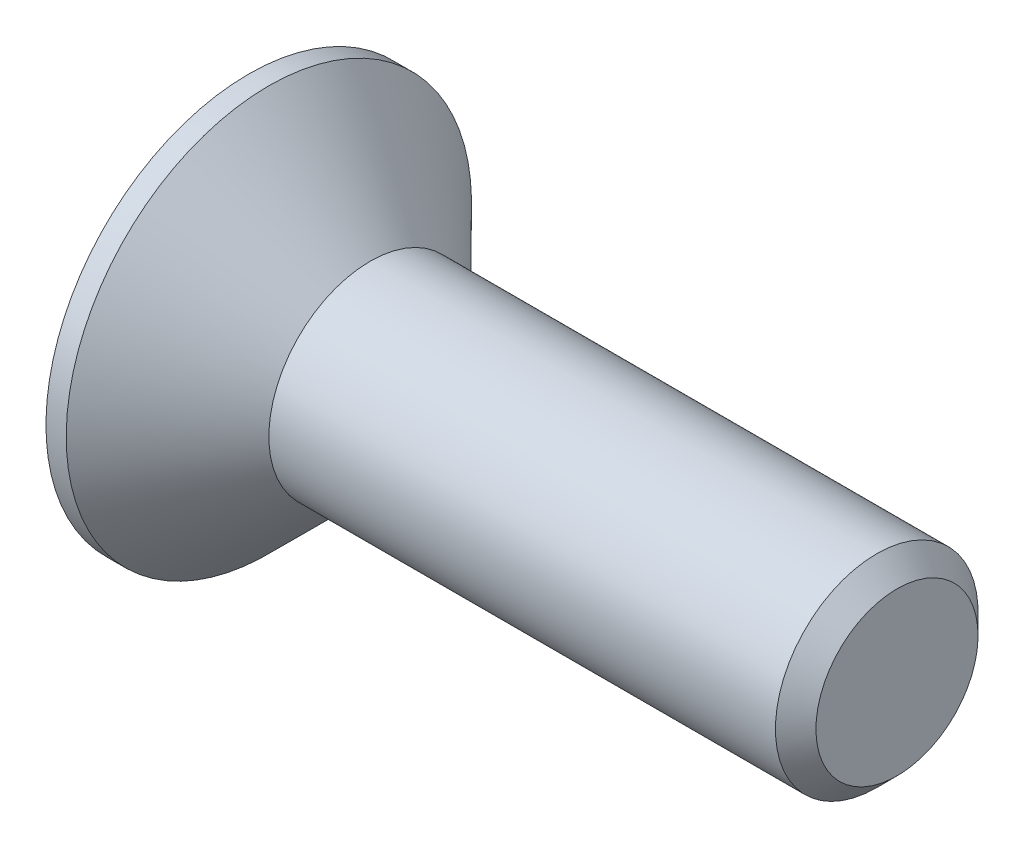
ISO-10303-21;
HEADER;
FILE_DESCRIPTION(('STEP AP214'),'2;1');
FILE_NAME('part.step','',(''),(''),'','','');
FILE_SCHEMA(('AUTOMOTIVE_DESIGN { 1 0 10303 214 1 1 1 1 }'));
ENDSEC;
DATA;
#1=APPLICATION_CONTEXT('core data for automotive mechanical design processes');
#2=APPLICATION_PROTOCOL_DEFINITION('international standard','automotive_design',2000,#1);
#3=PRODUCT_CONTEXT('',#1,'mechanical');
#4=PRODUCT('Part','Part','',(#3));
#5=PRODUCT_RELATED_PRODUCT_CATEGORY('part','',(#4));
#6=PRODUCT_DEFINITION_FORMATION('','',#4);
#7=PRODUCT_DEFINITION_CONTEXT('part definition',#1,'design');
#8=PRODUCT_DEFINITION('design','',#6,#7);
#9=PRODUCT_DEFINITION_SHAPE('','',#8);
#10=(LENGTH_UNIT() NAMED_UNIT(*) SI_UNIT(.MILLI.,.METRE.));
#11=(NAMED_UNIT(*) PLANE_ANGLE_UNIT() SI_UNIT($,.RADIAN.));
#12=(NAMED_UNIT(*) SI_UNIT($,.STERADIAN.) SOLID_ANGLE_UNIT());
#13=UNCERTAINTY_MEASURE_WITH_UNIT(LENGTH_MEASURE(1.E-05),#10,'distance_accuracy_value','');
#14=(GEOMETRIC_REPRESENTATION_CONTEXT(3) GLOBAL_UNCERTAINTY_ASSIGNED_CONTEXT((#13)) GLOBAL_UNIT_ASSIGNED_CONTEXT((#10,
#11,#12)) REPRESENTATION_CONTEXT('',''));
#15=CARTESIAN_POINT('',(0.,0.,0.));
#16=DIRECTION('',(0.,0.,1.));
#17=DIRECTION('',(1.,0.,0.));
#18=AXIS2_PLACEMENT_3D('',#15,#16,#17);
#19=CARTESIAN_POINT('',(0.,0.,0.));
#20=DIRECTION('',(-1.,0.,0.));
#21=DIRECTION('',(0.,-1.,0.));
#22=AXIS2_PLACEMENT_3D('',#19,#20,#21);
#23=PLANE('',#22);
#24=DIRECTION('',(0.,0.5,-0.866025403784439));
#25=VECTOR('',#24,1.);
#26=CARTESIAN_POINT('',(0.,0.866025403784439,1.5));
#27=LINE('',#26,#25);
#28=CARTESIAN_POINT('',(0.,0.866025403784439,1.5));
#29=VERTEX_POINT('',#28);
#30=CARTESIAN_POINT('',(0.,1.73205080756888,0.));
#31=VERTEX_POINT('',#30);
#32=EDGE_CURVE('E48',#29,#31,#27,.T.);
#33=ORIENTED_EDGE('',*,*,#32,.F.);
#34=DIRECTION('',(0.,1.,0.));
#35=VECTOR('',#34,1.);
#36=CARTESIAN_POINT('',(0.,-0.86602540378444,1.5));
#37=LINE('',#36,#35);
#38=CARTESIAN_POINT('',(0.,-0.86602540378444,1.5));
#39=VERTEX_POINT('',#38);
#40=EDGE_CURVE('E131',#39,#29,#37,.T.);
#41=ORIENTED_EDGE('',*,*,#40,.F.);
#42=DIRECTION('',(0.,0.5,0.866025403784439));
#43=VECTOR('',#42,1.);
#44=CARTESIAN_POINT('',(0.,-1.73205080756888,0.));
#45=LINE('',#44,#43);
#46=CARTESIAN_POINT('',(0.,-1.73205080756888,0.));
#47=VERTEX_POINT('',#46);
#48=EDGE_CURVE('E129',#47,#39,#45,.T.);
#49=ORIENTED_EDGE('',*,*,#48,.F.);
#50=DIRECTION('',(0.,-0.5,0.866025403784438));
#51=VECTOR('',#50,1.);
#52=CARTESIAN_POINT('',(0.,-0.866025403784439,-1.5));
#53=LINE('',#52,#51);
#54=CARTESIAN_POINT('',(0.,-0.866025403784439,-1.5));
#55=VERTEX_POINT('',#54);
#56=EDGE_CURVE('E96',#55,#47,#53,.T.);
#57=ORIENTED_EDGE('',*,*,#56,.F.);
#58=DIRECTION('',(0.,-1.,0.));
#59=VECTOR('',#58,1.);
#60=CARTESIAN_POINT('',(0.,0.866025403784439,-1.5));
#61=LINE('',#60,#59);
#62=CARTESIAN_POINT('',(0.,0.866025403784439,-1.5));
#63=VERTEX_POINT('',#62);
#64=EDGE_CURVE('E125',#63,#55,#61,.T.);
#65=ORIENTED_EDGE('',*,*,#64,.F.);
#66=DIRECTION('',(0.,-0.5,-0.866025403784439));
#67=VECTOR('',#66,1.);
#68=CARTESIAN_POINT('',(0.,1.73205080756888,0.));
#69=LINE('',#68,#67);
#70=EDGE_CURVE('E122',#31,#63,#69,.T.);
#71=ORIENTED_EDGE('',*,*,#70,.F.);
#72=EDGE_LOOP('',(#33,#41,#49,#57,#65,#71));
#73=FACE_BOUND('',#72,.T.);
#74=CARTESIAN_POINT('',(0.,0.,0.));
#75=DIRECTION('',(1.,0.,0.));
#76=DIRECTION('',(0.,1.,0.));
#77=AXIS2_PLACEMENT_3D('',#74,#75,#76);
#78=CIRCLE('',#77,5.);
#79=CARTESIAN_POINT('',(0.,5.,0.));
#80=VERTEX_POINT('',#79);
#81=EDGE_CURVE('E146',#80,#80,#78,.T.);
#82=ORIENTED_EDGE('',*,*,#81,.F.);
#83=EDGE_LOOP('',(#82));
#84=FACE_BOUND('',#83,.T.);
#85=ADVANCED_FACE('F33',(#73,#84),#23,.T.);
#86=CARTESIAN_POINT('',(16.,0.,0.));
#87=DIRECTION('',(1.,0.,0.));
#88=DIRECTION('',(0.,1.,0.));
#89=AXIS2_PLACEMENT_3D('',#86,#87,#88);
#90=CYLINDRICAL_SURFACE('',#89,5.);
#91=ORIENTED_EDGE('',*,*,#81,.T.);
#92=EDGE_LOOP('',(#91));
#93=FACE_BOUND('',#92,.T.);
#94=CARTESIAN_POINT('',(0.49999999999994,0.,0.));
#95=DIRECTION('',(1.,0.,0.));
#96=DIRECTION('',(0.,1.,0.));
#97=AXIS2_PLACEMENT_3D('',#94,#95,#96);
#98=CIRCLE('',#97,5.);
#99=CARTESIAN_POINT('',(0.499999999999939,5.,0.));
#100=VERTEX_POINT('',#99);
#101=EDGE_CURVE('E143',#100,#100,#98,.T.);
#102=ORIENTED_EDGE('',*,*,#101,.F.);
#103=EDGE_LOOP('',(#102));
#104=FACE_BOUND('',#103,.T.);
#105=ADVANCED_FACE('F166',(#93,#104),#90,.T.);
#106=CARTESIAN_POINT('',(3.,0.,0.));
#107=DIRECTION('',(-1.,0.,0.));
#108=DIRECTION('',(0.,-1.,0.));
#109=AXIS2_PLACEMENT_3D('',#106,#107,#108);
#110=CONICAL_SURFACE('',#109,2.5,0.785398163397437);
#111=ORIENTED_EDGE('',*,*,#101,.T.);
#112=EDGE_LOOP('',(#111));
#113=FACE_BOUND('',#112,.T.);
#114=CARTESIAN_POINT('',(3.,0.,0.));
#115=DIRECTION('',(1.,0.,0.));
#116=DIRECTION('',(0.,1.,0.));
#117=AXIS2_PLACEMENT_3D('',#114,#115,#116);
#118=CIRCLE('',#117,2.5);
#119=CARTESIAN_POINT('',(3.,2.5,0.));
#120=VERTEX_POINT('',#119);
#121=EDGE_CURVE('E135',#120,#120,#118,.T.);
#122=ORIENTED_EDGE('',*,*,#121,.F.);
#123=EDGE_LOOP('',(#122));
#124=FACE_BOUND('',#123,.T.);
#125=ADVANCED_FACE('F171',(#113,#124),#110,.T.);
#126=CARTESIAN_POINT('',(16.,0.,0.));
#127=DIRECTION('',(1.,0.,0.));
#128=DIRECTION('',(0.,1.,0.));
#129=AXIS2_PLACEMENT_3D('',#126,#127,#128);
#130=CYLINDRICAL_SURFACE('',#129,2.5);
#131=CARTESIAN_POINT('',(15.5,0.,0.));
#132=DIRECTION('',(1.,0.,0.));
#133=DIRECTION('',(0.,1.,0.));
#134=AXIS2_PLACEMENT_3D('',#131,#132,#133);
#135=CIRCLE('',#134,2.5);
#136=CARTESIAN_POINT('',(15.5,2.5,0.));
#137=VERTEX_POINT('',#136);
#138=EDGE_CURVE('E11',#137,#137,#135,.F.);
#139=ORIENTED_EDGE('',*,*,#138,.T.);
#140=EDGE_LOOP('',(#139));
#141=FACE_BOUND('',#140,.T.);
#142=ORIENTED_EDGE('',*,*,#121,.T.);
#143=EDGE_LOOP('',(#142));
#144=FACE_BOUND('',#143,.T.);
#145=ADVANCED_FACE('F162',(#141,#144),#130,.T.);
#146=CARTESIAN_POINT('',(16.,2.5,0.));
#147=DIRECTION('',(1.,0.,0.));
#148=DIRECTION('',(0.,1.,0.));
#149=AXIS2_PLACEMENT_3D('',#146,#147,#148);
#150=PLANE('',#149);
#151=CARTESIAN_POINT('',(16.,0.,0.));
#152=DIRECTION('',(1.,0.,0.));
#153=DIRECTION('',(0.,1.,0.));
#154=AXIS2_PLACEMENT_3D('',#151,#152,#153);
#155=CIRCLE('',#154,1.99999999999999);
#156=CARTESIAN_POINT('',(16.,2.,0.));
#157=VERTEX_POINT('',#156);
#158=EDGE_CURVE('E41',#157,#157,#155,.T.);
#159=ORIENTED_EDGE('',*,*,#158,.T.);
#160=EDGE_LOOP('',(#159));
#161=FACE_BOUND('',#160,.T.);
#162=ADVANCED_FACE('F151',(#161),#150,.T.);
#163=CARTESIAN_POINT('',(16.,0.,0.));
#164=DIRECTION('',(-1.,0.,0.));
#165=DIRECTION('',(0.,-1.,0.));
#166=AXIS2_PLACEMENT_3D('',#163,#164,#165);
#167=CONICAL_SURFACE('',#166,1.99999999999999,0.785398163397445);
#168=ORIENTED_EDGE('',*,*,#138,.F.);
#169=EDGE_LOOP('',(#168));
#170=FACE_BOUND('',#169,.T.);
#171=ORIENTED_EDGE('',*,*,#158,.F.);
#172=EDGE_LOOP('',(#171));
#173=FACE_BOUND('',#172,.T.);
#174=ADVANCED_FACE('F35',(#170,#173),#167,.T.);
#175=CARTESIAN_POINT('',(2.3,0.866025403784438,1.5));
#176=DIRECTION('',(0.,0.866025403784439,0.5));
#177=DIRECTION('',(0.,-0.5,0.866025403784439));
#178=AXIS2_PLACEMENT_3D('',#175,#176,#177);
#179=PLANE('',#178);
#180=ORIENTED_EDGE('',*,*,#32,.T.);
#181=DIRECTION('',(-1.,0.,0.));
#182=VECTOR('',#181,1.);
#183=CARTESIAN_POINT('',(2.3,1.73205080756888,0.));
#184=LINE('',#183,#182);
#185=CARTESIAN_POINT('',(2.3,1.73205080756888,0.));
#186=VERTEX_POINT('',#185);
#187=EDGE_CURVE('E78',#186,#31,#184,.T.);
#188=ORIENTED_EDGE('',*,*,#187,.F.);
#189=DIRECTION('',(0.,0.5,-0.866025403784439));
#190=VECTOR('',#189,1.);
#191=CARTESIAN_POINT('',(2.3,0.866025403784438,1.5));
#192=LINE('',#191,#190);
#193=CARTESIAN_POINT('',(2.3,0.866025403784438,1.5));
#194=VERTEX_POINT('',#193);
#195=EDGE_CURVE('E133',#194,#186,#192,.T.);
#196=ORIENTED_EDGE('',*,*,#195,.F.);
#197=DIRECTION('',(-1.,0.,0.));
#198=VECTOR('',#197,1.);
#199=CARTESIAN_POINT('',(2.3,0.866025403784438,1.5));
#200=LINE('',#199,#198);
#201=EDGE_CURVE('E56',#194,#29,#200,.T.);
#202=ORIENTED_EDGE('',*,*,#201,.T.);
#203=EDGE_LOOP('',(#180,#188,#196,#202));
#204=FACE_BOUND('',#203,.T.);
#205=ADVANCED_FACE('F154',(#204),#179,.F.);
#206=CARTESIAN_POINT('',(2.3,-0.86602540378444,1.5));
#207=DIRECTION('',(0.,0.,1.));
#208=DIRECTION('',(0.,-1.,0.));
#209=AXIS2_PLACEMENT_3D('',#206,#207,#208);
#210=PLANE('',#209);
#211=ORIENTED_EDGE('',*,*,#40,.T.);
#212=ORIENTED_EDGE('',*,*,#201,.F.);
#213=DIRECTION('',(0.,1.,0.));
#214=VECTOR('',#213,1.);
#215=CARTESIAN_POINT('',(2.3,-0.86602540378444,1.5));
#216=LINE('',#215,#214);
#217=CARTESIAN_POINT('',(2.3,-0.86602540378444,1.5));
#218=VERTEX_POINT('',#217);
#219=EDGE_CURVE('E108',#218,#194,#216,.T.);
#220=ORIENTED_EDGE('',*,*,#219,.F.);
#221=DIRECTION('',(-1.,0.,0.));
#222=VECTOR('',#221,1.);
#223=CARTESIAN_POINT('',(2.3,-0.86602540378444,1.5));
#224=LINE('',#223,#222);
#225=EDGE_CURVE('E100',#218,#39,#224,.T.);
#226=ORIENTED_EDGE('',*,*,#225,.T.);
#227=EDGE_LOOP('',(#211,#212,#220,#226));
#228=FACE_BOUND('',#227,.T.);
#229=ADVANCED_FACE('F160',(#228),#210,.F.);
#230=CARTESIAN_POINT('',(2.3,-1.73205080756888,0.));
#231=DIRECTION('',(0.,-0.866025403784439,0.5));
#232=DIRECTION('',(0.,-0.5,-0.866025403784439));
#233=AXIS2_PLACEMENT_3D('',#230,#231,#232);
#234=PLANE('',#233);
#235=ORIENTED_EDGE('',*,*,#48,.T.);
#236=ORIENTED_EDGE('',*,*,#225,.F.);
#237=DIRECTION('',(0.,0.5,0.866025403784439));
#238=VECTOR('',#237,1.);
#239=CARTESIAN_POINT('',(2.3,-1.73205080756888,0.));
#240=LINE('',#239,#238);
#241=CARTESIAN_POINT('',(2.3,-1.73205080756888,0.));
#242=VERTEX_POINT('',#241);
#243=EDGE_CURVE('E104',#242,#218,#240,.T.);
#244=ORIENTED_EDGE('',*,*,#243,.F.);
#245=DIRECTION('',(-1.,0.,0.));
#246=VECTOR('',#245,1.);
#247=CARTESIAN_POINT('',(2.3,-1.73205080756888,0.));
#248=LINE('',#247,#246);
#249=EDGE_CURVE('E89',#242,#47,#248,.T.);
#250=ORIENTED_EDGE('',*,*,#249,.T.);
#251=EDGE_LOOP('',(#235,#236,#244,#250));
#252=FACE_BOUND('',#251,.T.);
#253=ADVANCED_FACE('F105',(#252),#234,.F.);
#254=CARTESIAN_POINT('',(2.3,-0.866025403784439,-1.5));
#255=DIRECTION('',(0.,-0.866025403784439,-0.5));
#256=DIRECTION('',(0.,0.5,-0.866025403784439));
#257=AXIS2_PLACEMENT_3D('',#254,#255,#256);
#258=PLANE('',#257);
#259=ORIENTED_EDGE('',*,*,#56,.T.);
#260=ORIENTED_EDGE('',*,*,#249,.F.);
#261=DIRECTION('',(0.,-0.5,0.866025403784438));
#262=VECTOR('',#261,1.);
#263=CARTESIAN_POINT('',(2.3,-0.866025403784439,-1.5));
#264=LINE('',#263,#262);
#265=CARTESIAN_POINT('',(2.3,-0.866025403784439,-1.5));
#266=VERTEX_POINT('',#265);
#267=EDGE_CURVE('E93',#266,#242,#264,.T.);
#268=ORIENTED_EDGE('',*,*,#267,.F.);
#269=DIRECTION('',(-1.,0.,0.));
#270=VECTOR('',#269,1.);
#271=CARTESIAN_POINT('',(2.3,-0.866025403784439,-1.5));
#272=LINE('',#271,#270);
#273=EDGE_CURVE('E101',#266,#55,#272,.T.);
#274=ORIENTED_EDGE('',*,*,#273,.T.);
#275=EDGE_LOOP('',(#259,#260,#268,#274));
#276=FACE_BOUND('',#275,.T.);
#277=ADVANCED_FACE('F91',(#276),#258,.F.);
#278=CARTESIAN_POINT('',(2.3,0.866025403784438,-1.5));
#279=DIRECTION('',(0.,0.,-1.));
#280=DIRECTION('',(-1.,0.,0.));
#281=AXIS2_PLACEMENT_3D('',#278,#279,#280);
#282=PLANE('',#281);
#283=ORIENTED_EDGE('',*,*,#64,.T.);
#284=ORIENTED_EDGE('',*,*,#273,.F.);
#285=DIRECTION('',(0.,-1.,0.));
#286=VECTOR('',#285,1.);
#287=CARTESIAN_POINT('',(2.3,0.866025403784438,-1.5));
#288=LINE('',#287,#286);
#289=CARTESIAN_POINT('',(2.3,0.866025403784438,-1.5));
#290=VERTEX_POINT('',#289);
#291=EDGE_CURVE('E114',#290,#266,#288,.T.);
#292=ORIENTED_EDGE('',*,*,#291,.F.);
#293=DIRECTION('',(-1.,0.,0.));
#294=VECTOR('',#293,1.);
#295=CARTESIAN_POINT('',(2.3,0.866025403784438,-1.5));
#296=LINE('',#295,#294);
#297=EDGE_CURVE('E138',#290,#63,#296,.T.);
#298=ORIENTED_EDGE('',*,*,#297,.T.);
#299=EDGE_LOOP('',(#283,#284,#292,#298));
#300=FACE_BOUND('',#299,.T.);
#301=ADVANCED_FACE('F185',(#300),#282,.F.);
#302=CARTESIAN_POINT('',(2.3,1.73205080756888,0.));
#303=DIRECTION('',(0.,0.866025403784439,-0.5));
#304=DIRECTION('',(0.,0.5,0.866025403784439));
#305=AXIS2_PLACEMENT_3D('',#302,#303,#304);
#306=PLANE('',#305);
#307=ORIENTED_EDGE('',*,*,#70,.T.);
#308=ORIENTED_EDGE('',*,*,#297,.F.);
#309=DIRECTION('',(0.,-0.5,-0.866025403784439));
#310=VECTOR('',#309,1.);
#311=CARTESIAN_POINT('',(2.3,1.73205080756888,0.));
#312=LINE('',#311,#310);
#313=EDGE_CURVE('E116',#186,#290,#312,.T.);
#314=ORIENTED_EDGE('',*,*,#313,.F.);
#315=ORIENTED_EDGE('',*,*,#187,.T.);
#316=EDGE_LOOP('',(#307,#308,#314,#315));
#317=FACE_BOUND('',#316,.T.);
#318=ADVANCED_FACE('F182',(#317),#306,.F.);
#319=CARTESIAN_POINT('',(2.3,0.,0.));
#320=DIRECTION('',(-1.,0.,0.));
#321=DIRECTION('',(0.,-1.,0.));
#322=AXIS2_PLACEMENT_3D('',#319,#320,#321);
#323=PLANE('',#322);
#324=ORIENTED_EDGE('',*,*,#195,.T.);
#325=ORIENTED_EDGE('',*,*,#313,.T.);
#326=ORIENTED_EDGE('',*,*,#291,.T.);
#327=ORIENTED_EDGE('',*,*,#267,.T.);
#328=ORIENTED_EDGE('',*,*,#243,.T.);
#329=ORIENTED_EDGE('',*,*,#219,.T.);
#330=EDGE_LOOP('',(#324,#325,#326,#327,#328,#329));
#331=FACE_BOUND('',#330,.T.);
#332=ADVANCED_FACE('F111',(#331),#323,.T.);
#333=CLOSED_SHELL('',(#85,#105,#125,#145,#162,#174,#205,#229,#253,#277,#301,#318,#332));
#334=MANIFOLD_SOLID_BREP('B2',#333);
#335=ADVANCED_BREP_SHAPE_REPRESENTATION('',(#18,#334),#14);
#336=SHAPE_DEFINITION_REPRESENTATION(#9,#335);
ENDSEC;
END-ISO-10303-21;
